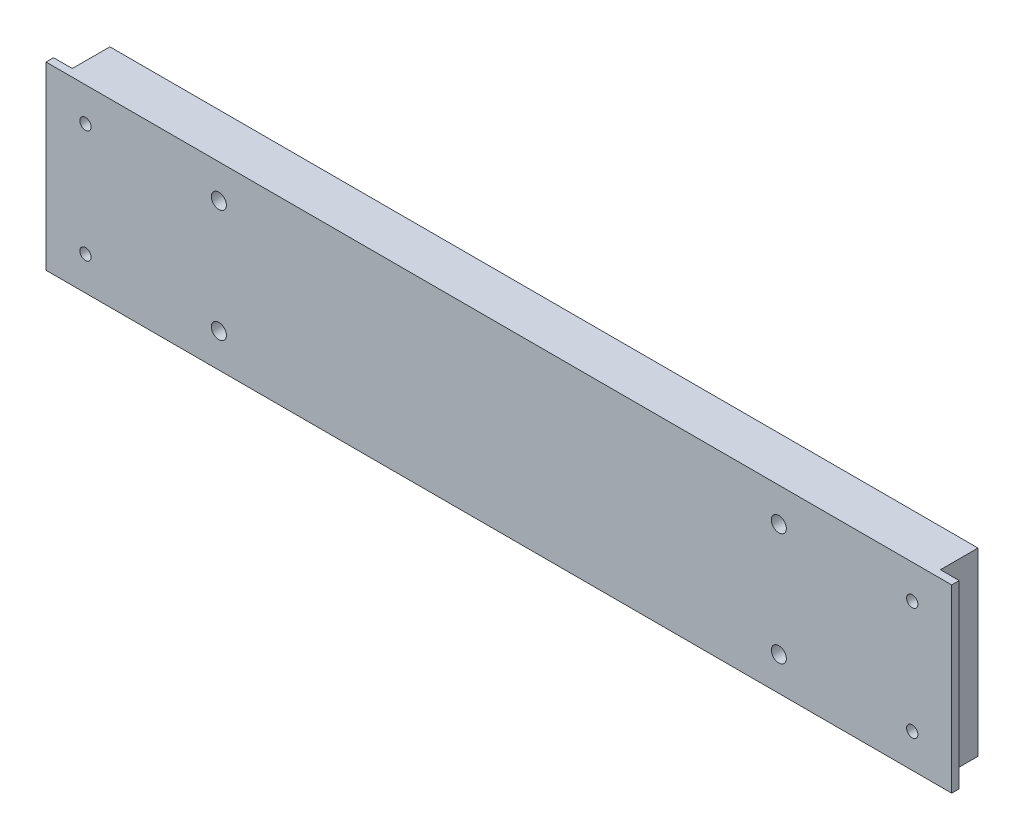
ISO-10303-21;
HEADER;
FILE_DESCRIPTION(('STEP AP214'),'2;1');
FILE_NAME('part.step','',(''),(''),'','','');
FILE_SCHEMA(('AUTOMOTIVE_DESIGN { 1 0 10303 214 1 1 1 1 }'));
ENDSEC;
DATA;
#1=APPLICATION_CONTEXT('core data for automotive mechanical design processes');
#2=APPLICATION_PROTOCOL_DEFINITION('international standard','automotive_design',2000,#1);
#3=PRODUCT_CONTEXT('',#1,'mechanical');
#4=PRODUCT('Part','Part','',(#3));
#5=PRODUCT_RELATED_PRODUCT_CATEGORY('part','',(#4));
#6=PRODUCT_DEFINITION_FORMATION('','',#4);
#7=PRODUCT_DEFINITION_CONTEXT('part definition',#1,'design');
#8=PRODUCT_DEFINITION('design','',#6,#7);
#9=PRODUCT_DEFINITION_SHAPE('','',#8);
#10=(LENGTH_UNIT() NAMED_UNIT(*) SI_UNIT(.MILLI.,.METRE.));
#11=(NAMED_UNIT(*) PLANE_ANGLE_UNIT() SI_UNIT($,.RADIAN.));
#12=(NAMED_UNIT(*) SI_UNIT($,.STERADIAN.) SOLID_ANGLE_UNIT());
#13=UNCERTAINTY_MEASURE_WITH_UNIT(LENGTH_MEASURE(1.E-05),#10,'distance_accuracy_value','');
#14=(GEOMETRIC_REPRESENTATION_CONTEXT(3) GLOBAL_UNCERTAINTY_ASSIGNED_CONTEXT((#13)) GLOBAL_UNIT_ASSIGNED_CONTEXT((#10,
#11,#12)) REPRESENTATION_CONTEXT('',''));
#15=CARTESIAN_POINT('',(0.,0.,0.));
#16=DIRECTION('',(0.,0.,1.));
#17=DIRECTION('',(1.,0.,0.));
#18=AXIS2_PLACEMENT_3D('',#15,#16,#17);
#19=CARTESIAN_POINT('',(0.,-48.,12.));
#20=DIRECTION('',(0.,0.,1.));
#21=DIRECTION('',(1.,0.,0.));
#22=AXIS2_PLACEMENT_3D('',#19,#20,#21);
#23=PLANE('',#22);
#24=CARTESIAN_POINT('',(46.,-8.99999999999999,12.));
#25=DIRECTION('',(0.,0.,1.));
#26=DIRECTION('',(1.,0.,0.));
#27=AXIS2_PLACEMENT_3D('',#24,#25,#26);
#28=CIRCLE('',#27,2.);
#29=CARTESIAN_POINT('',(48.,-8.99999999999999,12.));
#30=VERTEX_POINT('',#29);
#31=EDGE_CURVE('E171',#30,#30,#28,.T.);
#32=ORIENTED_EDGE('',*,*,#31,.F.);
#33=EDGE_LOOP('',(#32));
#34=FACE_BOUND('',#33,.T.);
#35=CARTESIAN_POINT('',(195.,-39.,12.));
#36=DIRECTION('',(0.,0.,1.));
#37=DIRECTION('',(-1.,0.,0.));
#38=AXIS2_PLACEMENT_3D('',#35,#36,#37);
#39=CIRCLE('',#38,2.00000000000002);
#40=CARTESIAN_POINT('',(193.,-39.,12.));
#41=VERTEX_POINT('',#40);
#42=EDGE_CURVE('E183',#41,#41,#39,.T.);
#43=ORIENTED_EDGE('',*,*,#42,.F.);
#44=EDGE_LOOP('',(#43));
#45=FACE_BOUND('',#44,.T.);
#46=CARTESIAN_POINT('',(230.5,-39.,12.));
#47=DIRECTION('',(0.,0.,1.));
#48=DIRECTION('',(-1.,0.,0.));
#49=AXIS2_PLACEMENT_3D('',#46,#47,#48);
#50=CIRCLE('',#49,1.5);
#51=CARTESIAN_POINT('',(229.,-39.,12.));
#52=VERTEX_POINT('',#51);
#53=EDGE_CURVE('E195',#52,#52,#50,.T.);
#54=ORIENTED_EDGE('',*,*,#53,.F.);
#55=EDGE_LOOP('',(#54));
#56=FACE_BOUND('',#55,.T.);
#57=CARTESIAN_POINT('',(10.5,-9.,12.));
#58=DIRECTION('',(0.,0.,1.));
#59=DIRECTION('',(1.,0.,0.));
#60=AXIS2_PLACEMENT_3D('',#57,#58,#59);
#61=CIRCLE('',#60,1.5);
#62=CARTESIAN_POINT('',(12.,-9.,12.));
#63=VERTEX_POINT('',#62);
#64=EDGE_CURVE('E120',#63,#63,#61,.T.);
#65=ORIENTED_EDGE('',*,*,#64,.F.);
#66=EDGE_LOOP('',(#65));
#67=FACE_BOUND('',#66,.T.);
#68=DIRECTION('',(0.,-1.,0.));
#69=VECTOR('',#68,1.);
#70=CARTESIAN_POINT('',(0.,0.,12.));
#71=LINE('',#70,#69);
#72=CARTESIAN_POINT('',(0.,0.,12.));
#73=VERTEX_POINT('',#72);
#74=CARTESIAN_POINT('',(0.,-48.,12.));
#75=VERTEX_POINT('',#74);
#76=EDGE_CURVE('E122',#73,#75,#71,.T.);
#77=ORIENTED_EDGE('',*,*,#76,.T.);
#78=DIRECTION('',(1.,0.,0.));
#79=VECTOR('',#78,1.);
#80=CARTESIAN_POINT('',(0.,-48.,12.));
#81=LINE('',#80,#79);
#82=CARTESIAN_POINT('',(241.,-48.,12.));
#83=VERTEX_POINT('',#82);
#84=EDGE_CURVE('E146',#75,#83,#81,.T.);
#85=ORIENTED_EDGE('',*,*,#84,.T.);
#86=DIRECTION('',(0.,1.,0.));
#87=VECTOR('',#86,1.);
#88=CARTESIAN_POINT('',(241.,0.,12.));
#89=LINE('',#88,#87);
#90=CARTESIAN_POINT('',(241.,0.,12.));
#91=VERTEX_POINT('',#90);
#92=EDGE_CURVE('E144',#83,#91,#89,.T.);
#93=ORIENTED_EDGE('',*,*,#92,.T.);
#94=DIRECTION('',(-1.,0.,0.));
#95=VECTOR('',#94,1.);
#96=CARTESIAN_POINT('',(0.,0.,12.));
#97=LINE('',#96,#95);
#98=EDGE_CURVE('E128',#91,#73,#97,.T.);
#99=ORIENTED_EDGE('',*,*,#98,.T.);
#100=EDGE_LOOP('',(#77,#85,#93,#99));
#101=FACE_BOUND('',#100,.T.);
#102=CARTESIAN_POINT('',(10.5,-39.,12.));
#103=DIRECTION('',(0.,0.,1.));
#104=DIRECTION('',(1.,0.,0.));
#105=AXIS2_PLACEMENT_3D('',#102,#103,#104);
#106=CIRCLE('',#105,1.5);
#107=CARTESIAN_POINT('',(12.,-39.,12.));
#108=VERTEX_POINT('',#107);
#109=EDGE_CURVE('E201',#108,#108,#106,.T.);
#110=ORIENTED_EDGE('',*,*,#109,.F.);
#111=EDGE_LOOP('',(#110));
#112=FACE_BOUND('',#111,.T.);
#113=CARTESIAN_POINT('',(230.5,-8.99999999999998,12.));
#114=DIRECTION('',(0.,0.,1.));
#115=DIRECTION('',(-1.,0.,0.));
#116=AXIS2_PLACEMENT_3D('',#113,#114,#115);
#117=CIRCLE('',#116,1.5);
#118=CARTESIAN_POINT('',(229.,-8.99999999999998,12.));
#119=VERTEX_POINT('',#118);
#120=EDGE_CURVE('E189',#119,#119,#117,.T.);
#121=ORIENTED_EDGE('',*,*,#120,.F.);
#122=EDGE_LOOP('',(#121));
#123=FACE_BOUND('',#122,.T.);
#124=CARTESIAN_POINT('',(195.,-8.99999999999999,12.));
#125=DIRECTION('',(0.,0.,1.));
#126=DIRECTION('',(-1.,0.,0.));
#127=AXIS2_PLACEMENT_3D('',#124,#125,#126);
#128=CIRCLE('',#127,2.00000000000002);
#129=CARTESIAN_POINT('',(193.,-8.99999999999999,12.));
#130=VERTEX_POINT('',#129);
#131=EDGE_CURVE('E177',#130,#130,#128,.T.);
#132=ORIENTED_EDGE('',*,*,#131,.F.);
#133=EDGE_LOOP('',(#132));
#134=FACE_BOUND('',#133,.T.);
#135=CARTESIAN_POINT('',(46.,-39.,12.));
#136=DIRECTION('',(0.,0.,1.));
#137=DIRECTION('',(1.,0.,0.));
#138=AXIS2_PLACEMENT_3D('',#135,#136,#137);
#139=CIRCLE('',#138,2.);
#140=CARTESIAN_POINT('',(48.,-39.,12.));
#141=VERTEX_POINT('',#140);
#142=EDGE_CURVE('E165',#141,#141,#139,.T.);
#143=ORIENTED_EDGE('',*,*,#142,.F.);
#144=EDGE_LOOP('',(#143));
#145=FACE_BOUND('',#144,.T.);
#146=ADVANCED_FACE('F30',(#34,#45,#56,#67,#101,#112,#123,#134,#145),#23,.T.);
#147=CARTESIAN_POINT('',(0.,-48.,0.));
#148=DIRECTION('',(0.,0.,1.));
#149=DIRECTION('',(1.,0.,0.));
#150=AXIS2_PLACEMENT_3D('',#147,#148,#149);
#151=PLANE('',#150);
#152=CARTESIAN_POINT('',(46.,-8.99999999999999,0.));
#153=DIRECTION('',(0.,0.,1.));
#154=DIRECTION('',(1.,0.,0.));
#155=AXIS2_PLACEMENT_3D('',#152,#153,#154);
#156=CIRCLE('',#155,2.);
#157=CARTESIAN_POINT('',(48.,-8.99999999999999,0.));
#158=VERTEX_POINT('',#157);
#159=EDGE_CURVE('E168',#158,#158,#156,.T.);
#160=ORIENTED_EDGE('',*,*,#159,.T.);
#161=EDGE_LOOP('',(#160));
#162=FACE_BOUND('',#161,.T.);
#163=CARTESIAN_POINT('',(195.,-39.,0.));
#164=DIRECTION('',(0.,0.,1.));
#165=DIRECTION('',(-1.,0.,0.));
#166=AXIS2_PLACEMENT_3D('',#163,#164,#165);
#167=CIRCLE('',#166,2.00000000000002);
#168=CARTESIAN_POINT('',(193.,-39.,0.));
#169=VERTEX_POINT('',#168);
#170=EDGE_CURVE('E180',#169,#169,#167,.T.);
#171=ORIENTED_EDGE('',*,*,#170,.T.);
#172=EDGE_LOOP('',(#171));
#173=FACE_BOUND('',#172,.T.);
#174=CARTESIAN_POINT('',(230.5,-39.,0.));
#175=DIRECTION('',(0.,0.,1.));
#176=DIRECTION('',(-1.,0.,0.));
#177=AXIS2_PLACEMENT_3D('',#174,#175,#176);
#178=CIRCLE('',#177,1.5);
#179=CARTESIAN_POINT('',(229.,-39.,0.));
#180=VERTEX_POINT('',#179);
#181=EDGE_CURVE('E192',#180,#180,#178,.T.);
#182=ORIENTED_EDGE('',*,*,#181,.T.);
#183=EDGE_LOOP('',(#182));
#184=FACE_BOUND('',#183,.T.);
#185=CARTESIAN_POINT('',(10.5,-9.,0.));
#186=DIRECTION('',(0.,0.,1.));
#187=DIRECTION('',(1.,0.,0.));
#188=AXIS2_PLACEMENT_3D('',#185,#186,#187);
#189=CIRCLE('',#188,1.5);
#190=CARTESIAN_POINT('',(12.,-9.,0.));
#191=VERTEX_POINT('',#190);
#192=EDGE_CURVE('E125',#191,#191,#189,.T.);
#193=ORIENTED_EDGE('',*,*,#192,.T.);
#194=EDGE_LOOP('',(#193));
#195=FACE_BOUND('',#194,.T.);
#196=DIRECTION('',(1.,0.,0.));
#197=VECTOR('',#196,1.);
#198=CARTESIAN_POINT('',(0.,-48.,0.));
#199=LINE('',#198,#197);
#200=CARTESIAN_POINT('',(5.,-48.,0.));
#201=VERTEX_POINT('',#200);
#202=CARTESIAN_POINT('',(236.,-48.,0.));
#203=VERTEX_POINT('',#202);
#204=EDGE_CURVE('E114',#201,#203,#199,.T.);
#205=ORIENTED_EDGE('',*,*,#204,.F.);
#206=DIRECTION('',(0.,1.,0.));
#207=VECTOR('',#206,1.);
#208=CARTESIAN_POINT('',(5.,-48.,0.));
#209=LINE('',#208,#207);
#210=CARTESIAN_POINT('',(5.,0.,0.));
#211=VERTEX_POINT('',#210);
#212=EDGE_CURVE('E98',#201,#211,#209,.T.);
#213=ORIENTED_EDGE('',*,*,#212,.T.);
#214=DIRECTION('',(-1.,0.,0.));
#215=VECTOR('',#214,1.);
#216=CARTESIAN_POINT('',(0.,0.,0.));
#217=LINE('',#216,#215);
#218=CARTESIAN_POINT('',(236.,0.,0.));
#219=VERTEX_POINT('',#218);
#220=EDGE_CURVE('E119',#219,#211,#217,.T.);
#221=ORIENTED_EDGE('',*,*,#220,.F.);
#222=DIRECTION('',(0.,1.,0.));
#223=VECTOR('',#222,1.);
#224=CARTESIAN_POINT('',(236.,-48.,0.));
#225=LINE('',#224,#223);
#226=EDGE_CURVE('E53',#203,#219,#225,.T.);
#227=ORIENTED_EDGE('',*,*,#226,.F.);
#228=EDGE_LOOP('',(#205,#213,#221,#227));
#229=FACE_BOUND('',#228,.T.);
#230=CARTESIAN_POINT('',(10.5,-39.,0.));
#231=DIRECTION('',(0.,0.,1.));
#232=DIRECTION('',(1.,0.,0.));
#233=AXIS2_PLACEMENT_3D('',#230,#231,#232);
#234=CIRCLE('',#233,1.5);
#235=CARTESIAN_POINT('',(12.,-39.,0.));
#236=VERTEX_POINT('',#235);
#237=EDGE_CURVE('E198',#236,#236,#234,.T.);
#238=ORIENTED_EDGE('',*,*,#237,.T.);
#239=EDGE_LOOP('',(#238));
#240=FACE_BOUND('',#239,.T.);
#241=CARTESIAN_POINT('',(230.5,-8.99999999999998,0.));
#242=DIRECTION('',(0.,0.,1.));
#243=DIRECTION('',(-1.,0.,0.));
#244=AXIS2_PLACEMENT_3D('',#241,#242,#243);
#245=CIRCLE('',#244,1.5);
#246=CARTESIAN_POINT('',(229.,-8.99999999999998,0.));
#247=VERTEX_POINT('',#246);
#248=EDGE_CURVE('E186',#247,#247,#245,.T.);
#249=ORIENTED_EDGE('',*,*,#248,.T.);
#250=EDGE_LOOP('',(#249));
#251=FACE_BOUND('',#250,.T.);
#252=CARTESIAN_POINT('',(195.,-8.99999999999999,0.));
#253=DIRECTION('',(0.,0.,1.));
#254=DIRECTION('',(-1.,0.,0.));
#255=AXIS2_PLACEMENT_3D('',#252,#253,#254);
#256=CIRCLE('',#255,2.00000000000002);
#257=CARTESIAN_POINT('',(193.,-8.99999999999999,0.));
#258=VERTEX_POINT('',#257);
#259=EDGE_CURVE('E174',#258,#258,#256,.T.);
#260=ORIENTED_EDGE('',*,*,#259,.T.);
#261=EDGE_LOOP('',(#260));
#262=FACE_BOUND('',#261,.T.);
#263=CARTESIAN_POINT('',(46.,-39.,0.));
#264=DIRECTION('',(0.,0.,1.));
#265=DIRECTION('',(1.,0.,0.));
#266=AXIS2_PLACEMENT_3D('',#263,#264,#265);
#267=CIRCLE('',#266,2.);
#268=CARTESIAN_POINT('',(48.,-39.,0.));
#269=VERTEX_POINT('',#268);
#270=EDGE_CURVE('E163',#269,#269,#267,.T.);
#271=ORIENTED_EDGE('',*,*,#270,.T.);
#272=EDGE_LOOP('',(#271));
#273=FACE_BOUND('',#272,.T.);
#274=ADVANCED_FACE('F117',(#162,#173,#184,#195,#229,#240,#251,#262,#273),#151,.F.);
#275=CARTESIAN_POINT('',(0.,0.,12.));
#276=DIRECTION('',(1.,0.,0.));
#277=DIRECTION('',(0.,1.,0.));
#278=AXIS2_PLACEMENT_3D('',#275,#276,#277);
#279=PLANE('',#278);
#280=DIRECTION('',(0.,0.,-1.));
#281=VECTOR('',#280,1.);
#282=CARTESIAN_POINT('',(0.,0.,12.));
#283=LINE('',#282,#281);
#284=CARTESIAN_POINT('',(0.,0.,10.));
#285=VERTEX_POINT('',#284);
#286=EDGE_CURVE('E131',#73,#285,#283,.T.);
#287=ORIENTED_EDGE('',*,*,#286,.T.);
#288=DIRECTION('',(0.,1.,0.));
#289=VECTOR('',#288,1.);
#290=CARTESIAN_POINT('',(0.,-48.,10.));
#291=LINE('',#290,#289);
#292=CARTESIAN_POINT('',(0.,-48.,10.));
#293=VERTEX_POINT('',#292);
#294=EDGE_CURVE('E45',#293,#285,#291,.T.);
#295=ORIENTED_EDGE('',*,*,#294,.F.);
#296=DIRECTION('',(0.,0.,-1.));
#297=VECTOR('',#296,1.);
#298=CARTESIAN_POINT('',(0.,-48.,12.));
#299=LINE('',#298,#297);
#300=EDGE_CURVE('E11',#75,#293,#299,.T.);
#301=ORIENTED_EDGE('',*,*,#300,.F.);
#302=ORIENTED_EDGE('',*,*,#76,.F.);
#303=EDGE_LOOP('',(#287,#295,#301,#302));
#304=FACE_BOUND('',#303,.T.);
#305=ADVANCED_FACE('F32',(#304),#279,.F.);
#306=CARTESIAN_POINT('',(0.,-48.,12.));
#307=DIRECTION('',(0.,1.,0.));
#308=DIRECTION('',(-1.,0.,0.));
#309=AXIS2_PLACEMENT_3D('',#306,#307,#308);
#310=PLANE('',#309);
#311=DIRECTION('',(1.,0.,0.));
#312=VECTOR('',#311,1.);
#313=CARTESIAN_POINT('',(5.,-48.,10.));
#314=LINE('',#313,#312);
#315=CARTESIAN_POINT('',(5.,-48.,10.));
#316=VERTEX_POINT('',#315);
#317=EDGE_CURVE('E109',#293,#316,#314,.T.);
#318=ORIENTED_EDGE('',*,*,#317,.T.);
#319=DIRECTION('',(0.,0.,-1.));
#320=VECTOR('',#319,1.);
#321=CARTESIAN_POINT('',(5.,-48.,0.));
#322=LINE('',#321,#320);
#323=EDGE_CURVE('E101',#316,#201,#322,.T.);
#324=ORIENTED_EDGE('',*,*,#323,.T.);
#325=ORIENTED_EDGE('',*,*,#204,.T.);
#326=DIRECTION('',(0.,0.,1.));
#327=VECTOR('',#326,1.);
#328=CARTESIAN_POINT('',(236.,-48.,0.));
#329=LINE('',#328,#327);
#330=CARTESIAN_POINT('',(236.,-48.,10.));
#331=VERTEX_POINT('',#330);
#332=EDGE_CURVE('E150',#203,#331,#329,.T.);
#333=ORIENTED_EDGE('',*,*,#332,.T.);
#334=DIRECTION('',(1.,0.,0.));
#335=VECTOR('',#334,1.);
#336=CARTESIAN_POINT('',(236.,-48.,10.));
#337=LINE('',#336,#335);
#338=CARTESIAN_POINT('',(241.,-48.,10.));
#339=VERTEX_POINT('',#338);
#340=EDGE_CURVE('E149',#331,#339,#337,.T.);
#341=ORIENTED_EDGE('',*,*,#340,.T.);
#342=DIRECTION('',(0.,0.,-1.));
#343=VECTOR('',#342,1.);
#344=CARTESIAN_POINT('',(241.,-48.,12.));
#345=LINE('',#344,#343);
#346=EDGE_CURVE('E38',#83,#339,#345,.T.);
#347=ORIENTED_EDGE('',*,*,#346,.F.);
#348=ORIENTED_EDGE('',*,*,#84,.F.);
#349=ORIENTED_EDGE('',*,*,#300,.T.);
#350=EDGE_LOOP('',(#318,#324,#325,#333,#341,#347,#348,#349));
#351=FACE_BOUND('',#350,.T.);
#352=ADVANCED_FACE('F112',(#351),#310,.F.);
#353=CARTESIAN_POINT('',(241.,0.,12.));
#354=DIRECTION('',(-1.,0.,0.));
#355=DIRECTION('',(0.,0.,1.));
#356=AXIS2_PLACEMENT_3D('',#353,#354,#355);
#357=PLANE('',#356);
#358=ORIENTED_EDGE('',*,*,#346,.T.);
#359=DIRECTION('',(0.,1.,0.));
#360=VECTOR('',#359,1.);
#361=CARTESIAN_POINT('',(241.,-48.,10.));
#362=LINE('',#361,#360);
#363=CARTESIAN_POINT('',(241.,0.,10.));
#364=VERTEX_POINT('',#363);
#365=EDGE_CURVE('E143',#339,#364,#362,.T.);
#366=ORIENTED_EDGE('',*,*,#365,.T.);
#367=DIRECTION('',(0.,0.,-1.));
#368=VECTOR('',#367,1.);
#369=CARTESIAN_POINT('',(241.,0.,12.));
#370=LINE('',#369,#368);
#371=EDGE_CURVE('E134',#91,#364,#370,.T.);
#372=ORIENTED_EDGE('',*,*,#371,.F.);
#373=ORIENTED_EDGE('',*,*,#92,.F.);
#374=EDGE_LOOP('',(#358,#366,#372,#373));
#375=FACE_BOUND('',#374,.T.);
#376=ADVANCED_FACE('F141',(#375),#357,.F.);
#377=CARTESIAN_POINT('',(0.,0.,12.));
#378=DIRECTION('',(0.,-1.,0.));
#379=DIRECTION('',(1.,0.,0.));
#380=AXIS2_PLACEMENT_3D('',#377,#378,#379);
#381=PLANE('',#380);
#382=ORIENTED_EDGE('',*,*,#220,.T.);
#383=DIRECTION('',(0.,0.,-1.));
#384=VECTOR('',#383,1.);
#385=CARTESIAN_POINT('',(5.,0.,0.));
#386=LINE('',#385,#384);
#387=CARTESIAN_POINT('',(5.,0.,10.));
#388=VERTEX_POINT('',#387);
#389=EDGE_CURVE('E104',#388,#211,#386,.T.);
#390=ORIENTED_EDGE('',*,*,#389,.F.);
#391=DIRECTION('',(1.,0.,0.));
#392=VECTOR('',#391,1.);
#393=CARTESIAN_POINT('',(5.,0.,10.));
#394=LINE('',#393,#392);
#395=EDGE_CURVE('E115',#285,#388,#394,.T.);
#396=ORIENTED_EDGE('',*,*,#395,.F.);
#397=ORIENTED_EDGE('',*,*,#286,.F.);
#398=ORIENTED_EDGE('',*,*,#98,.F.);
#399=ORIENTED_EDGE('',*,*,#371,.T.);
#400=DIRECTION('',(1.,0.,0.));
#401=VECTOR('',#400,1.);
#402=CARTESIAN_POINT('',(236.,0.,10.));
#403=LINE('',#402,#401);
#404=CARTESIAN_POINT('',(236.,0.,10.));
#405=VERTEX_POINT('',#404);
#406=EDGE_CURVE('E155',#405,#364,#403,.T.);
#407=ORIENTED_EDGE('',*,*,#406,.F.);
#408=DIRECTION('',(0.,0.,1.));
#409=VECTOR('',#408,1.);
#410=CARTESIAN_POINT('',(236.,0.,0.));
#411=LINE('',#410,#409);
#412=EDGE_CURVE('E158',#219,#405,#411,.T.);
#413=ORIENTED_EDGE('',*,*,#412,.F.);
#414=EDGE_LOOP('',(#382,#390,#396,#397,#398,#399,#407,#413));
#415=FACE_BOUND('',#414,.T.);
#416=ADVANCED_FACE('F216',(#415),#381,.F.);
#417=CARTESIAN_POINT('',(10.5,-9.,12.));
#418=DIRECTION('',(0.,0.,-1.));
#419=DIRECTION('',(-1.,0.,0.));
#420=AXIS2_PLACEMENT_3D('',#417,#418,#419);
#421=CYLINDRICAL_SURFACE('',#420,1.5);
#422=ORIENTED_EDGE('',*,*,#64,.T.);
#423=EDGE_LOOP('',(#422));
#424=FACE_BOUND('',#423,.T.);
#425=ORIENTED_EDGE('',*,*,#192,.F.);
#426=EDGE_LOOP('',(#425));
#427=FACE_BOUND('',#426,.T.);
#428=ADVANCED_FACE('F250',(#424,#427),#421,.F.);
#429=CARTESIAN_POINT('',(10.5,-39.,12.));
#430=DIRECTION('',(0.,0.,-1.));
#431=DIRECTION('',(-1.,0.,0.));
#432=AXIS2_PLACEMENT_3D('',#429,#430,#431);
#433=CYLINDRICAL_SURFACE('',#432,1.5);
#434=ORIENTED_EDGE('',*,*,#109,.T.);
#435=EDGE_LOOP('',(#434));
#436=FACE_BOUND('',#435,.T.);
#437=ORIENTED_EDGE('',*,*,#237,.F.);
#438=EDGE_LOOP('',(#437));
#439=FACE_BOUND('',#438,.T.);
#440=ADVANCED_FACE('F323',(#436,#439),#433,.F.);
#441=CARTESIAN_POINT('',(230.5,-39.,12.));
#442=DIRECTION('',(0.,0.,-1.));
#443=DIRECTION('',(-1.,0.,0.));
#444=AXIS2_PLACEMENT_3D('',#441,#442,#443);
#445=CYLINDRICAL_SURFACE('',#444,1.5);
#446=ORIENTED_EDGE('',*,*,#53,.T.);
#447=EDGE_LOOP('',(#446));
#448=FACE_BOUND('',#447,.T.);
#449=ORIENTED_EDGE('',*,*,#181,.F.);
#450=EDGE_LOOP('',(#449));
#451=FACE_BOUND('',#450,.T.);
#452=ADVANCED_FACE('F313',(#448,#451),#445,.F.);
#453=CARTESIAN_POINT('',(230.5,-8.99999999999998,12.));
#454=DIRECTION('',(0.,0.,-1.));
#455=DIRECTION('',(-1.,0.,0.));
#456=AXIS2_PLACEMENT_3D('',#453,#454,#455);
#457=CYLINDRICAL_SURFACE('',#456,1.5);
#458=ORIENTED_EDGE('',*,*,#120,.T.);
#459=EDGE_LOOP('',(#458));
#460=FACE_BOUND('',#459,.T.);
#461=ORIENTED_EDGE('',*,*,#248,.F.);
#462=EDGE_LOOP('',(#461));
#463=FACE_BOUND('',#462,.T.);
#464=ADVANCED_FACE('F303',(#460,#463),#457,.F.);
#465=CARTESIAN_POINT('',(195.,-39.,12.));
#466=DIRECTION('',(0.,0.,-1.));
#467=DIRECTION('',(-1.,0.,0.));
#468=AXIS2_PLACEMENT_3D('',#465,#466,#467);
#469=CYLINDRICAL_SURFACE('',#468,2.00000000000002);
#470=ORIENTED_EDGE('',*,*,#42,.T.);
#471=EDGE_LOOP('',(#470));
#472=FACE_BOUND('',#471,.T.);
#473=ORIENTED_EDGE('',*,*,#170,.F.);
#474=EDGE_LOOP('',(#473));
#475=FACE_BOUND('',#474,.T.);
#476=ADVANCED_FACE('F293',(#472,#475),#469,.F.);
#477=CARTESIAN_POINT('',(195.,-8.99999999999999,12.));
#478=DIRECTION('',(0.,0.,-1.));
#479=DIRECTION('',(-1.,0.,0.));
#480=AXIS2_PLACEMENT_3D('',#477,#478,#479);
#481=CYLINDRICAL_SURFACE('',#480,2.00000000000002);
#482=ORIENTED_EDGE('',*,*,#131,.T.);
#483=EDGE_LOOP('',(#482));
#484=FACE_BOUND('',#483,.T.);
#485=ORIENTED_EDGE('',*,*,#259,.F.);
#486=EDGE_LOOP('',(#485));
#487=FACE_BOUND('',#486,.T.);
#488=ADVANCED_FACE('F283',(#484,#487),#481,.F.);
#489=CARTESIAN_POINT('',(46.,-8.99999999999999,12.));
#490=DIRECTION('',(0.,0.,-1.));
#491=DIRECTION('',(-1.,0.,0.));
#492=AXIS2_PLACEMENT_3D('',#489,#490,#491);
#493=CYLINDRICAL_SURFACE('',#492,2.);
#494=ORIENTED_EDGE('',*,*,#31,.T.);
#495=EDGE_LOOP('',(#494));
#496=FACE_BOUND('',#495,.T.);
#497=ORIENTED_EDGE('',*,*,#159,.F.);
#498=EDGE_LOOP('',(#497));
#499=FACE_BOUND('',#498,.T.);
#500=ADVANCED_FACE('F235',(#496,#499),#493,.F.);
#501=CARTESIAN_POINT('',(46.,-39.,12.));
#502=DIRECTION('',(0.,0.,-1.));
#503=DIRECTION('',(-1.,0.,0.));
#504=AXIS2_PLACEMENT_3D('',#501,#502,#503);
#505=CYLINDRICAL_SURFACE('',#504,2.);
#506=ORIENTED_EDGE('',*,*,#142,.T.);
#507=EDGE_LOOP('',(#506));
#508=FACE_BOUND('',#507,.T.);
#509=ORIENTED_EDGE('',*,*,#270,.F.);
#510=EDGE_LOOP('',(#509));
#511=FACE_BOUND('',#510,.T.);
#512=ADVANCED_FACE('F228',(#508,#511),#505,.F.);
#513=CARTESIAN_POINT('',(236.,-48.,10.));
#514=DIRECTION('',(0.,0.,1.));
#515=DIRECTION('',(1.,0.,0.));
#516=AXIS2_PLACEMENT_3D('',#513,#514,#515);
#517=PLANE('',#516);
#518=ORIENTED_EDGE('',*,*,#406,.T.);
#519=ORIENTED_EDGE('',*,*,#365,.F.);
#520=ORIENTED_EDGE('',*,*,#340,.F.);
#521=DIRECTION('',(0.,1.,0.));
#522=VECTOR('',#521,1.);
#523=CARTESIAN_POINT('',(236.,-48.,10.));
#524=LINE('',#523,#522);
#525=EDGE_CURVE('E153',#331,#405,#524,.T.);
#526=ORIENTED_EDGE('',*,*,#525,.T.);
#527=EDGE_LOOP('',(#518,#519,#520,#526));
#528=FACE_BOUND('',#527,.T.);
#529=ADVANCED_FACE('F226',(#528),#517,.F.);
#530=CARTESIAN_POINT('',(236.,-48.,0.));
#531=DIRECTION('',(-1.,0.,0.));
#532=DIRECTION('',(0.,0.,1.));
#533=AXIS2_PLACEMENT_3D('',#530,#531,#532);
#534=PLANE('',#533);
#535=ORIENTED_EDGE('',*,*,#412,.T.);
#536=ORIENTED_EDGE('',*,*,#525,.F.);
#537=ORIENTED_EDGE('',*,*,#332,.F.);
#538=ORIENTED_EDGE('',*,*,#226,.T.);
#539=EDGE_LOOP('',(#535,#536,#537,#538));
#540=FACE_BOUND('',#539,.T.);
#541=ADVANCED_FACE('F225',(#540),#534,.F.);
#542=CARTESIAN_POINT('',(5.,-48.,0.));
#543=DIRECTION('',(1.,0.,0.));
#544=DIRECTION('',(0.,0.,-1.));
#545=AXIS2_PLACEMENT_3D('',#542,#543,#544);
#546=PLANE('',#545);
#547=ORIENTED_EDGE('',*,*,#389,.T.);
#548=ORIENTED_EDGE('',*,*,#212,.F.);
#549=ORIENTED_EDGE('',*,*,#323,.F.);
#550=DIRECTION('',(0.,1.,0.));
#551=VECTOR('',#550,1.);
#552=CARTESIAN_POINT('',(5.,-48.,10.));
#553=LINE('',#552,#551);
#554=EDGE_CURVE('E160',#316,#388,#553,.T.);
#555=ORIENTED_EDGE('',*,*,#554,.T.);
#556=EDGE_LOOP('',(#547,#548,#549,#555));
#557=FACE_BOUND('',#556,.T.);
#558=ADVANCED_FACE('F100',(#557),#546,.F.);
#559=CARTESIAN_POINT('',(5.,-48.,10.));
#560=DIRECTION('',(0.,0.,1.));
#561=DIRECTION('',(1.,0.,0.));
#562=AXIS2_PLACEMENT_3D('',#559,#560,#561);
#563=PLANE('',#562);
#564=ORIENTED_EDGE('',*,*,#395,.T.);
#565=ORIENTED_EDGE('',*,*,#554,.F.);
#566=ORIENTED_EDGE('',*,*,#317,.F.);
#567=ORIENTED_EDGE('',*,*,#294,.T.);
#568=EDGE_LOOP('',(#564,#565,#566,#567));
#569=FACE_BOUND('',#568,.T.);
#570=ADVANCED_FACE('F223',(#569),#563,.F.);
#571=CLOSED_SHELL('',(#146,#274,#305,#352,#376,#416,#428,#440,#452,#464,#476,#488,#500,#512,
#529,#541,#558,#570));
#572=MANIFOLD_SOLID_BREP('B2',#571);
#573=ADVANCED_BREP_SHAPE_REPRESENTATION('',(#18,#572),#14);
#574=SHAPE_DEFINITION_REPRESENTATION(#9,#573);
ENDSEC;
END-ISO-10303-21;
